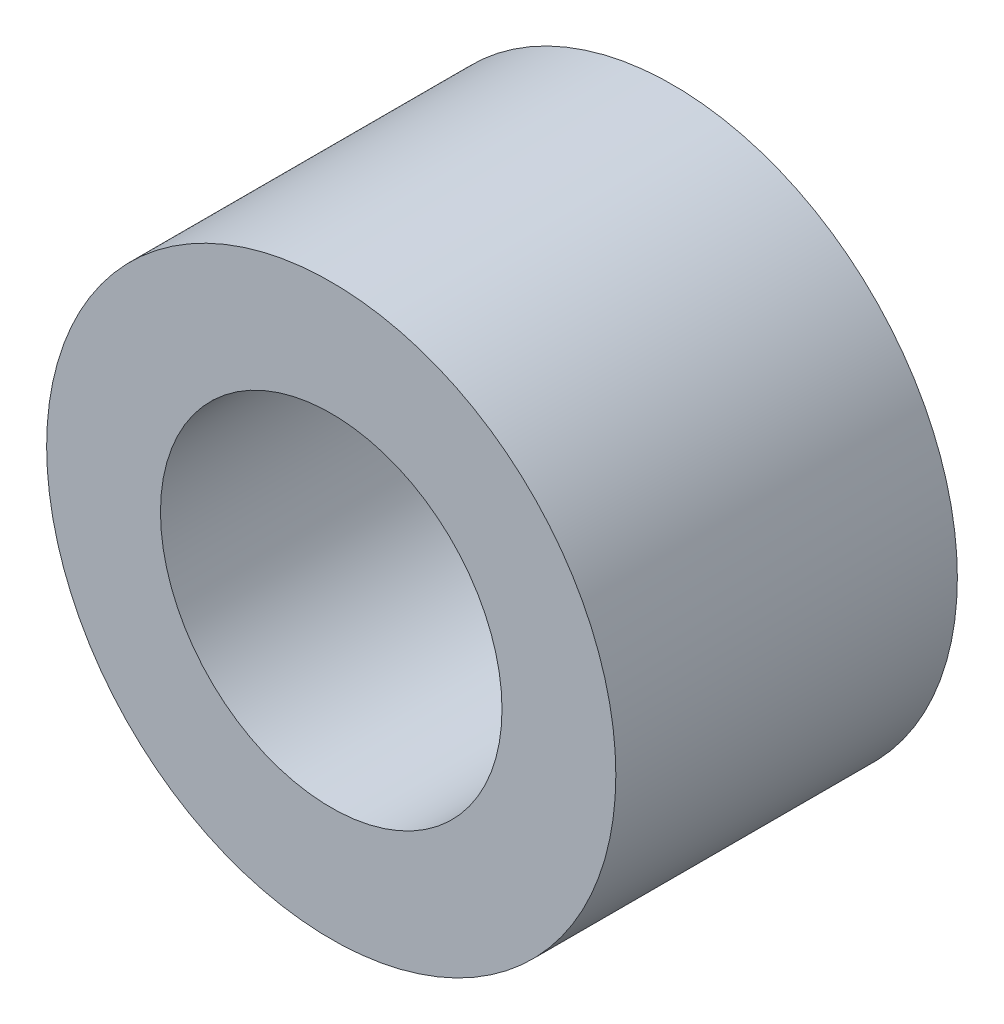
ISO-10303-21;
HEADER;
FILE_DESCRIPTION(('STEP AP214'),'2;1');
FILE_NAME('part.step','',(''),(''),'','','');
FILE_SCHEMA(('AUTOMOTIVE_DESIGN { 1 0 10303 214 1 1 1 1 }'));
ENDSEC;
DATA;
#1=APPLICATION_CONTEXT('core data for automotive mechanical design processes');
#2=APPLICATION_PROTOCOL_DEFINITION('international standard','automotive_design',2000,#1);
#3=PRODUCT_CONTEXT('',#1,'mechanical');
#4=PRODUCT('Part','Part','',(#3));
#5=PRODUCT_RELATED_PRODUCT_CATEGORY('part','',(#4));
#6=PRODUCT_DEFINITION_FORMATION('','',#4);
#7=PRODUCT_DEFINITION_CONTEXT('part definition',#1,'design');
#8=PRODUCT_DEFINITION('design','',#6,#7);
#9=PRODUCT_DEFINITION_SHAPE('','',#8);
#10=(LENGTH_UNIT() NAMED_UNIT(*) SI_UNIT(.MILLI.,.METRE.));
#11=(NAMED_UNIT(*) PLANE_ANGLE_UNIT() SI_UNIT($,.RADIAN.));
#12=(NAMED_UNIT(*) SI_UNIT($,.STERADIAN.) SOLID_ANGLE_UNIT());
#13=UNCERTAINTY_MEASURE_WITH_UNIT(LENGTH_MEASURE(1.E-05),#10,'distance_accuracy_value','');
#14=(GEOMETRIC_REPRESENTATION_CONTEXT(3) GLOBAL_UNCERTAINTY_ASSIGNED_CONTEXT((#13)) GLOBAL_UNIT_ASSIGNED_CONTEXT((#10,
#11,#12)) REPRESENTATION_CONTEXT('',''));
#15=CARTESIAN_POINT('',(0.,0.,0.));
#16=DIRECTION('',(0.,0.,1.));
#17=DIRECTION('',(1.,0.,0.));
#18=AXIS2_PLACEMENT_3D('',#15,#16,#17);
#19=CARTESIAN_POINT('',(0.,0.,4.7625));
#20=DIRECTION('',(0.,0.,1.));
#21=DIRECTION('',(1.,0.,0.));
#22=AXIS2_PLACEMENT_3D('',#19,#20,#21);
#23=PLANE('',#22);
#24=CARTESIAN_POINT('',(0.,0.,4.7625));
#25=DIRECTION('',(0.,0.,1.));
#26=DIRECTION('',(1.,0.,0.));
#27=AXIS2_PLACEMENT_3D('',#24,#25,#26);
#28=CIRCLE('',#27,7.9375);
#29=CARTESIAN_POINT('',(7.9375,0.,4.7625));
#30=VERTEX_POINT('',#29);
#31=EDGE_CURVE('E10',#30,#30,#28,.T.);
#32=ORIENTED_EDGE('',*,*,#31,.T.);
#33=EDGE_LOOP('',(#32));
#34=FACE_BOUND('',#33,.T.);
#35=CARTESIAN_POINT('',(0.,0.,4.7625));
#36=DIRECTION('',(0.,0.,1.));
#37=DIRECTION('',(1.,0.,0.));
#38=AXIS2_PLACEMENT_3D('',#35,#36,#37);
#39=CIRCLE('',#38,4.7625);
#40=CARTESIAN_POINT('',(4.7625,0.,4.7625));
#41=VERTEX_POINT('',#40);
#42=EDGE_CURVE('E46',#41,#41,#39,.T.);
#43=ORIENTED_EDGE('',*,*,#42,.F.);
#44=EDGE_LOOP('',(#43));
#45=FACE_BOUND('',#44,.T.);
#46=ADVANCED_FACE('F35',(#34,#45),#23,.T.);
#47=CARTESIAN_POINT('',(0.,0.,-4.7625));
#48=DIRECTION('',(0.,0.,1.));
#49=DIRECTION('',(1.,0.,0.));
#50=AXIS2_PLACEMENT_3D('',#47,#48,#49);
#51=PLANE('',#50);
#52=CARTESIAN_POINT('',(0.,0.,-4.7625));
#53=DIRECTION('',(0.,0.,1.));
#54=DIRECTION('',(1.,0.,0.));
#55=AXIS2_PLACEMENT_3D('',#52,#53,#54);
#56=CIRCLE('',#55,7.9375);
#57=CARTESIAN_POINT('',(7.9375,0.,-4.7625));
#58=VERTEX_POINT('',#57);
#59=EDGE_CURVE('E39',#58,#58,#56,.T.);
#60=ORIENTED_EDGE('',*,*,#59,.F.);
#61=EDGE_LOOP('',(#60));
#62=FACE_BOUND('',#61,.T.);
#63=CARTESIAN_POINT('',(0.,0.,-4.7625));
#64=DIRECTION('',(0.,0.,1.));
#65=DIRECTION('',(1.,0.,0.));
#66=AXIS2_PLACEMENT_3D('',#63,#64,#65);
#67=CIRCLE('',#66,4.7625);
#68=CARTESIAN_POINT('',(4.7625,0.,-4.7625));
#69=VERTEX_POINT('',#68);
#70=EDGE_CURVE('E48',#69,#69,#67,.T.);
#71=ORIENTED_EDGE('',*,*,#70,.T.);
#72=EDGE_LOOP('',(#71));
#73=FACE_BOUND('',#72,.T.);
#74=ADVANCED_FACE('F58',(#62,#73),#51,.F.);
#75=CARTESIAN_POINT('',(0.,0.,4.7625));
#76=DIRECTION('',(0.,0.,-1.));
#77=DIRECTION('',(-1.,0.,0.));
#78=AXIS2_PLACEMENT_3D('',#75,#76,#77);
#79=CYLINDRICAL_SURFACE('',#78,7.9375);
#80=ORIENTED_EDGE('',*,*,#31,.F.);
#81=EDGE_LOOP('',(#80));
#82=FACE_BOUND('',#81,.T.);
#83=ORIENTED_EDGE('',*,*,#59,.T.);
#84=EDGE_LOOP('',(#83));
#85=FACE_BOUND('',#84,.T.);
#86=ADVANCED_FACE('F37',(#82,#85),#79,.T.);
#87=CARTESIAN_POINT('',(0.,0.,4.7625));
#88=DIRECTION('',(0.,0.,-1.));
#89=DIRECTION('',(-1.,0.,0.));
#90=AXIS2_PLACEMENT_3D('',#87,#88,#89);
#91=CYLINDRICAL_SURFACE('',#90,4.7625);
#92=ORIENTED_EDGE('',*,*,#42,.T.);
#93=EDGE_LOOP('',(#92));
#94=FACE_BOUND('',#93,.T.);
#95=ORIENTED_EDGE('',*,*,#70,.F.);
#96=EDGE_LOOP('',(#95));
#97=FACE_BOUND('',#96,.T.);
#98=ADVANCED_FACE('F54',(#94,#97),#91,.F.);
#99=CLOSED_SHELL('',(#46,#74,#86,#98));
#100=MANIFOLD_SOLID_BREP('B2',#99);
#101=ADVANCED_BREP_SHAPE_REPRESENTATION('',(#18,#100),#14);
#102=SHAPE_DEFINITION_REPRESENTATION(#9,#101);
ENDSEC;
END-ISO-10303-21;
